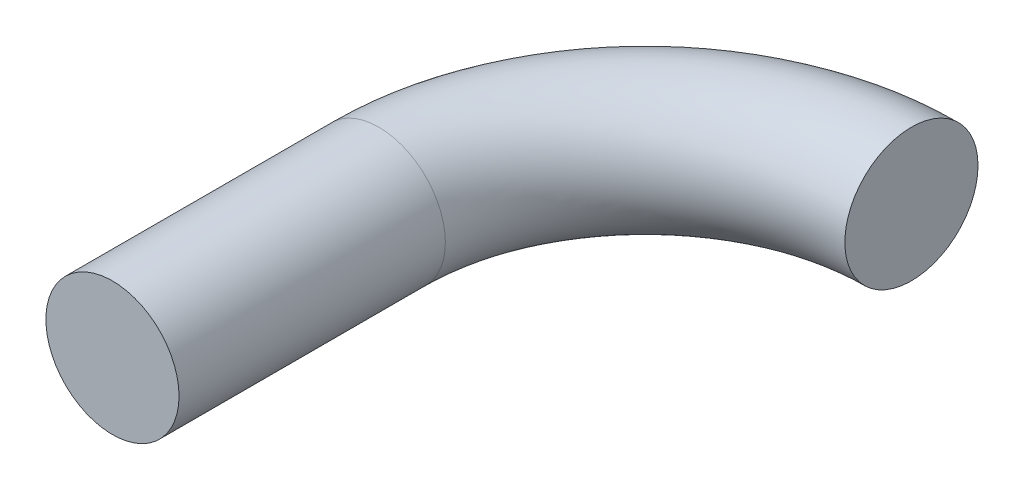
ISO-10303-21;
HEADER;
FILE_DESCRIPTION(('STEP AP214'),'2;1');
FILE_NAME('part.step','',(''),(''),'','','');
FILE_SCHEMA(('AUTOMOTIVE_DESIGN { 1 0 10303 214 1 1 1 1 }'));
ENDSEC;
DATA;
#1=APPLICATION_CONTEXT('core data for automotive mechanical design processes');
#2=APPLICATION_PROTOCOL_DEFINITION('international standard','automotive_design',2000,#1);
#3=PRODUCT_CONTEXT('',#1,'mechanical');
#4=PRODUCT('Part','Part','',(#3));
#5=PRODUCT_RELATED_PRODUCT_CATEGORY('part','',(#4));
#6=PRODUCT_DEFINITION_FORMATION('','',#4);
#7=PRODUCT_DEFINITION_CONTEXT('part definition',#1,'design');
#8=PRODUCT_DEFINITION('design','',#6,#7);
#9=PRODUCT_DEFINITION_SHAPE('','',#8);
#10=(LENGTH_UNIT() NAMED_UNIT(*) SI_UNIT(.MILLI.,.METRE.));
#11=(NAMED_UNIT(*) PLANE_ANGLE_UNIT() SI_UNIT($,.RADIAN.));
#12=(NAMED_UNIT(*) SI_UNIT($,.STERADIAN.) SOLID_ANGLE_UNIT());
#13=UNCERTAINTY_MEASURE_WITH_UNIT(LENGTH_MEASURE(1.E-05),#10,'distance_accuracy_value','');
#14=(GEOMETRIC_REPRESENTATION_CONTEXT(3) GLOBAL_UNCERTAINTY_ASSIGNED_CONTEXT((#13)) GLOBAL_UNIT_ASSIGNED_CONTEXT((#10,
#11,#12)) REPRESENTATION_CONTEXT('',''));
#15=CARTESIAN_POINT('',(0.,0.,0.));
#16=DIRECTION('',(0.,0.,1.));
#17=DIRECTION('',(1.,0.,0.));
#18=AXIS2_PLACEMENT_3D('',#15,#16,#17);
#19=CARTESIAN_POINT('',(50.8,0.,-50.8));
#20=DIRECTION('',(0.,-1.,0.));
#21=DIRECTION('',(0.,0.,-1.));
#22=AXIS2_PLACEMENT_3D('',#19,#20,#21);
#23=TOROIDAL_SURFACE('',#22,50.8,12.7);
#24=CARTESIAN_POINT('',(0.,0.,-50.8));
#25=DIRECTION('',(0.,0.,1.));
#26=DIRECTION('',(1.,0.,0.));
#27=AXIS2_PLACEMENT_3D('',#24,#25,#26);
#28=CIRCLE('',#27,12.7);
#29=CARTESIAN_POINT('',(-12.7,0.,-50.8));
#30=VERTEX_POINT('',#29);
#31=EDGE_CURVE('E35',#30,#30,#28,.T.);
#32=CARTESIAN_POINT('',(50.7999999999999,0.,-101.6));
#33=DIRECTION('',(-1.,0.,0.));
#34=DIRECTION('',(0.,0.,1.));
#35=AXIS2_PLACEMENT_3D('',#32,#33,#34);
#36=CIRCLE('',#35,12.7);
#37=CARTESIAN_POINT('',(50.7999999999999,0.,-114.3));
#38=VERTEX_POINT('',#37);
#39=EDGE_CURVE('E10',#38,#38,#36,.T.);
#40=CARTESIAN_POINT('',(50.8,0.,-50.8));
#41=DIRECTION('',(0.,-1.,0.));
#42=DIRECTION('',(0.,0.,-1.));
#43=AXIS2_PLACEMENT_3D('',#40,#41,#42);
#44=CIRCLE('',#43,63.5);
#45=EDGE_CURVE('',#30,#38,#44,.T.);
#46=ORIENTED_EDGE('',*,*,#31,.F.);
#47=ORIENTED_EDGE('',*,*,#39,.T.);
#48=ORIENTED_EDGE('',*,*,#45,.T.);
#49=ORIENTED_EDGE('',*,*,#45,.F.);
#50=EDGE_LOOP('',(#46,#48,#47,#49));
#51=FACE_BOUND('',#50,.T.);
#52=ADVANCED_FACE('F29',(#51),#23,.T.);
#53=CARTESIAN_POINT('',(0.,0.,-50.8));
#54=DIRECTION('',(0.,0.,1.));
#55=DIRECTION('',(1.,0.,0.));
#56=AXIS2_PLACEMENT_3D('',#53,#54,#55);
#57=CYLINDRICAL_SURFACE('',#56,12.7);
#58=ORIENTED_EDGE('',*,*,#31,.T.);
#59=EDGE_LOOP('',(#58));
#60=FACE_BOUND('',#59,.T.);
#61=CARTESIAN_POINT('',(0.,0.,0.));
#62=DIRECTION('',(0.,0.,1.));
#63=DIRECTION('',(1.,0.,0.));
#64=AXIS2_PLACEMENT_3D('',#61,#62,#63);
#65=CIRCLE('',#64,12.7);
#66=CARTESIAN_POINT('',(12.7,0.,0.));
#67=VERTEX_POINT('',#66);
#68=EDGE_CURVE('E39',#67,#67,#65,.T.);
#69=ORIENTED_EDGE('',*,*,#68,.F.);
#70=EDGE_LOOP('',(#69));
#71=FACE_BOUND('',#70,.T.);
#72=ADVANCED_FACE('F48',(#60,#71),#57,.T.);
#73=CARTESIAN_POINT('',(50.7999999999999,0.,-101.6));
#74=DIRECTION('',(-1.,0.,0.));
#75=DIRECTION('',(0.,0.,1.));
#76=AXIS2_PLACEMENT_3D('',#73,#74,#75);
#77=PLANE('',#76);
#78=ORIENTED_EDGE('',*,*,#39,.F.);
#79=EDGE_LOOP('',(#78));
#80=FACE_BOUND('',#79,.T.);
#81=ADVANCED_FACE('F50',(#80),#77,.F.);
#82=CARTESIAN_POINT('',(0.,0.,0.));
#83=DIRECTION('',(0.,0.,1.));
#84=DIRECTION('',(1.,0.,0.));
#85=AXIS2_PLACEMENT_3D('',#82,#83,#84);
#86=PLANE('',#85);
#87=ORIENTED_EDGE('',*,*,#68,.T.);
#88=EDGE_LOOP('',(#87));
#89=FACE_BOUND('',#88,.T.);
#90=ADVANCED_FACE('F46',(#89),#86,.T.);
#91=CLOSED_SHELL('',(#52,#72,#81,#90));
#92=MANIFOLD_SOLID_BREP('B2',#91);
#93=ADVANCED_BREP_SHAPE_REPRESENTATION('',(#18,#92),#14);
#94=SHAPE_DEFINITION_REPRESENTATION(#9,#93);
ENDSEC;
END-ISO-10303-21;
